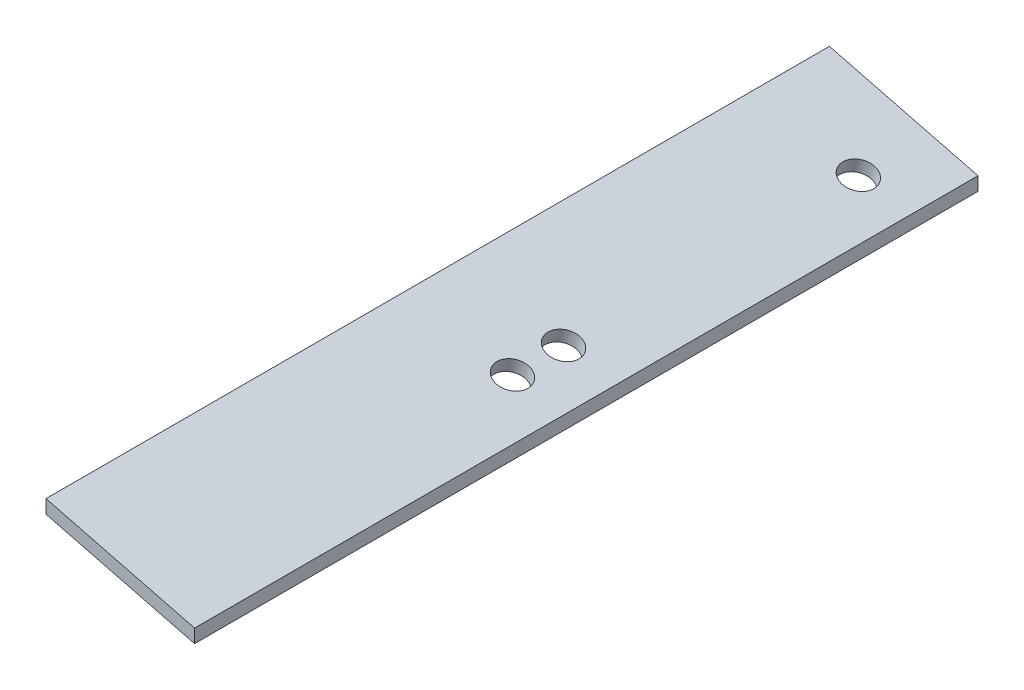
ISO-10303-21;
HEADER;
FILE_DESCRIPTION(('STEP AP214'),'2;1');
FILE_NAME('part.step','',(''),(''),'','','');
FILE_SCHEMA(('AUTOMOTIVE_DESIGN { 1 0 10303 214 1 1 1 1 }'));
ENDSEC;
DATA;
#1=APPLICATION_CONTEXT('core data for automotive mechanical design processes');
#2=APPLICATION_PROTOCOL_DEFINITION('international standard','automotive_design',2000,#1);
#3=PRODUCT_CONTEXT('',#1,'mechanical');
#4=PRODUCT('Part','Part','',(#3));
#5=PRODUCT_RELATED_PRODUCT_CATEGORY('part','',(#4));
#6=PRODUCT_DEFINITION_FORMATION('','',#4);
#7=PRODUCT_DEFINITION_CONTEXT('part definition',#1,'design');
#8=PRODUCT_DEFINITION('design','',#6,#7);
#9=PRODUCT_DEFINITION_SHAPE('','',#8);
#10=(LENGTH_UNIT() NAMED_UNIT(*) SI_UNIT(.MILLI.,.METRE.));
#11=(NAMED_UNIT(*) PLANE_ANGLE_UNIT() SI_UNIT($,.RADIAN.));
#12=(NAMED_UNIT(*) SI_UNIT($,.STERADIAN.) SOLID_ANGLE_UNIT());
#13=UNCERTAINTY_MEASURE_WITH_UNIT(LENGTH_MEASURE(1.E-05),#10,'distance_accuracy_value','');
#14=(GEOMETRIC_REPRESENTATION_CONTEXT(3) GLOBAL_UNCERTAINTY_ASSIGNED_CONTEXT((#13)) GLOBAL_UNIT_ASSIGNED_CONTEXT((#10,
#11,#12)) REPRESENTATION_CONTEXT('',''));
#15=CARTESIAN_POINT('',(0.,0.,0.));
#16=DIRECTION('',(0.,0.,1.));
#17=DIRECTION('',(1.,0.,0.));
#18=AXIS2_PLACEMENT_3D('',#15,#16,#17);
#19=CARTESIAN_POINT('',(120.,145.,-580.));
#20=DIRECTION('',(1.,0.,0.));
#21=DIRECTION('',(0.,1.,0.));
#22=AXIS2_PLACEMENT_3D('',#19,#20,#21);
#23=PLANE('',#22);
#24=DIRECTION('',(0.,1.,0.));
#25=VECTOR('',#24,1.);
#26=CARTESIAN_POINT('',(120.,145.,0.));
#27=LINE('',#26,#25);
#28=CARTESIAN_POINT('',(120.,145.,0.));
#29=VERTEX_POINT('',#28);
#30=CARTESIAN_POINT('',(120.,155.,0.));
#31=VERTEX_POINT('',#30);
#32=EDGE_CURVE('E97',#29,#31,#27,.T.);
#33=ORIENTED_EDGE('',*,*,#32,.F.);
#34=DIRECTION('',(0.,0.,1.));
#35=VECTOR('',#34,1.);
#36=CARTESIAN_POINT('',(120.,145.,-580.));
#37=LINE('',#36,#35);
#38=CARTESIAN_POINT('',(120.,145.,-580.));
#39=VERTEX_POINT('',#38);
#40=EDGE_CURVE('E11',#39,#29,#37,.T.);
#41=ORIENTED_EDGE('',*,*,#40,.F.);
#42=DIRECTION('',(0.,1.,0.));
#43=VECTOR('',#42,1.);
#44=CARTESIAN_POINT('',(120.,145.,-580.));
#45=LINE('',#44,#43);
#46=CARTESIAN_POINT('',(120.,155.,-580.));
#47=VERTEX_POINT('',#46);
#48=EDGE_CURVE('E90',#39,#47,#45,.T.);
#49=ORIENTED_EDGE('',*,*,#48,.T.);
#50=DIRECTION('',(0.,0.,1.));
#51=VECTOR('',#50,1.);
#52=CARTESIAN_POINT('',(120.,155.,-580.));
#53=LINE('',#52,#51);
#54=EDGE_CURVE('E35',#47,#31,#53,.T.);
#55=ORIENTED_EDGE('',*,*,#54,.T.);
#56=EDGE_LOOP('',(#33,#41,#49,#55));
#57=FACE_BOUND('',#56,.T.);
#58=ADVANCED_FACE('F32',(#57),#23,.T.);
#59=CARTESIAN_POINT('',(10.,173.,-580.));
#60=DIRECTION('',(-0.246679280634931,-0.969097173922942,0.));
#61=DIRECTION('',(0.969097173922942,-0.246679280634931,0.));
#62=AXIS2_PLACEMENT_3D('',#59,#60,#61);
#63=PLANE('',#62);
#64=CARTESIAN_POINT('',(82.0319778829853,154.664587447967,-527.));
#65=DIRECTION('',(-0.246679280634931,-0.969097173922942,0.));
#66=DIRECTION('',(0.969097173922942,-0.246679280634931,0.));
#67=AXIS2_PLACEMENT_3D('',#64,#65,#66);
#68=CIRCLE('',#67,11.8);
#69=CARTESIAN_POINT('',(93.467324535276,151.753771936475,-527.));
#70=VERTEX_POINT('',#69);
#71=EDGE_CURVE('E147',#70,#70,#68,.T.);
#72=ORIENTED_EDGE('',*,*,#71,.F.);
#73=EDGE_LOOP('',(#72));
#74=FACE_BOUND('',#73,.T.);
#75=CARTESIAN_POINT('',(82.0319778829851,154.664587447967,-270.946985720668));
#76=DIRECTION('',(-0.246679280634931,-0.969097173922942,0.));
#77=DIRECTION('',(0.969097173922942,-0.246679280634931,0.));
#78=AXIS2_PLACEMENT_3D('',#75,#76,#77);
#79=CIRCLE('',#78,11.8);
#80=CARTESIAN_POINT('',(93.4673245352758,151.753771936475,-270.946985720668));
#81=VERTEX_POINT('',#80);
#82=EDGE_CURVE('E140',#81,#81,#79,.T.);
#83=ORIENTED_EDGE('',*,*,#82,.F.);
#84=EDGE_LOOP('',(#83));
#85=FACE_BOUND('',#84,.T.);
#86=CARTESIAN_POINT('',(82.0319778829868,154.664587447967,-308.745926627754));
#87=DIRECTION('',(-0.246679280634931,-0.969097173922942,0.));
#88=DIRECTION('',(0.969097173922942,-0.246679280634931,0.));
#89=AXIS2_PLACEMENT_3D('',#86,#87,#88);
#90=CIRCLE('',#89,11.8);
#91=CARTESIAN_POINT('',(93.4673245352774,151.753771936475,-308.745926627754));
#92=VERTEX_POINT('',#91);
#93=EDGE_CURVE('E101',#92,#92,#90,.T.);
#94=ORIENTED_EDGE('',*,*,#93,.F.);
#95=EDGE_LOOP('',(#94));
#96=FACE_BOUND('',#95,.T.);
#97=DIRECTION('',(0.969097173922942,-0.246679280634931,0.));
#98=VECTOR('',#97,1.);
#99=CARTESIAN_POINT('',(10.,173.,0.));
#100=LINE('',#99,#98);
#101=CARTESIAN_POINT('',(10.,173.,0.));
#102=VERTEX_POINT('',#101);
#103=EDGE_CURVE('E92',#102,#29,#100,.T.);
#104=ORIENTED_EDGE('',*,*,#103,.F.);
#105=DIRECTION('',(0.,0.,1.));
#106=VECTOR('',#105,1.);
#107=CARTESIAN_POINT('',(10.,173.,-580.));
#108=LINE('',#107,#106);
#109=CARTESIAN_POINT('',(10.,173.,-580.));
#110=VERTEX_POINT('',#109);
#111=EDGE_CURVE('E41',#110,#102,#108,.T.);
#112=ORIENTED_EDGE('',*,*,#111,.F.);
#113=DIRECTION('',(0.969097173922942,-0.246679280634931,0.));
#114=VECTOR('',#113,1.);
#115=CARTESIAN_POINT('',(10.,173.,-580.));
#116=LINE('',#115,#114);
#117=EDGE_CURVE('E87',#110,#39,#116,.T.);
#118=ORIENTED_EDGE('',*,*,#117,.T.);
#119=ORIENTED_EDGE('',*,*,#40,.T.);
#120=EDGE_LOOP('',(#104,#112,#118,#119));
#121=FACE_BOUND('',#120,.T.);
#122=ADVANCED_FACE('F108',(#74,#85,#96,#121),#63,.T.);
#123=CARTESIAN_POINT('',(10.,183.,-580.));
#124=DIRECTION('',(-1.,0.,0.));
#125=DIRECTION('',(0.,0.,1.));
#126=AXIS2_PLACEMENT_3D('',#123,#124,#125);
#127=PLANE('',#126);
#128=DIRECTION('',(0.,-1.,0.));
#129=VECTOR('',#128,1.);
#130=CARTESIAN_POINT('',(10.,183.,0.));
#131=LINE('',#130,#129);
#132=CARTESIAN_POINT('',(10.,183.,0.));
#133=VERTEX_POINT('',#132);
#134=EDGE_CURVE('E82',#133,#102,#131,.T.);
#135=ORIENTED_EDGE('',*,*,#134,.F.);
#136=DIRECTION('',(0.,0.,1.));
#137=VECTOR('',#136,1.);
#138=CARTESIAN_POINT('',(10.,183.,-580.));
#139=LINE('',#138,#137);
#140=CARTESIAN_POINT('',(10.,183.,-580.));
#141=VERTEX_POINT('',#140);
#142=EDGE_CURVE('E77',#141,#133,#139,.T.);
#143=ORIENTED_EDGE('',*,*,#142,.F.);
#144=DIRECTION('',(0.,-1.,0.));
#145=VECTOR('',#144,1.);
#146=CARTESIAN_POINT('',(10.,183.,-580.));
#147=LINE('',#146,#145);
#148=EDGE_CURVE('E80',#141,#110,#147,.T.);
#149=ORIENTED_EDGE('',*,*,#148,.T.);
#150=ORIENTED_EDGE('',*,*,#111,.T.);
#151=EDGE_LOOP('',(#135,#143,#149,#150));
#152=FACE_BOUND('',#151,.T.);
#153=ADVANCED_FACE('F79',(#152),#127,.T.);
#154=CARTESIAN_POINT('',(120.,155.,-580.));
#155=DIRECTION('',(0.246679280634931,0.969097173922942,0.));
#156=DIRECTION('',(-0.969097173922942,0.246679280634931,0.));
#157=AXIS2_PLACEMENT_3D('',#154,#155,#156);
#158=PLANE('',#157);
#159=CARTESIAN_POINT('',(84.4225398202719,164.056080773022,-527.));
#160=DIRECTION('',(0.246679280634931,0.969097173922942,0.));
#161=DIRECTION('',(-0.969097173922942,0.246679280634931,0.));
#162=AXIS2_PLACEMENT_3D('',#159,#160,#161);
#163=CIRCLE('',#162,11.8);
#164=CARTESIAN_POINT('',(72.9871931679812,166.966896284514,-527.));
#165=VERTEX_POINT('',#164);
#166=EDGE_CURVE('E131',#165,#165,#163,.T.);
#167=ORIENTED_EDGE('',*,*,#166,.F.);
#168=EDGE_LOOP('',(#167));
#169=FACE_BOUND('',#168,.T.);
#170=CARTESIAN_POINT('',(84.4225398202717,164.056080773022,-270.946985720668));
#171=DIRECTION('',(0.246679280634931,0.969097173922942,0.));
#172=DIRECTION('',(-0.969097173922942,0.246679280634931,0.));
#173=AXIS2_PLACEMENT_3D('',#170,#171,#172);
#174=CIRCLE('',#173,11.8);
#175=CARTESIAN_POINT('',(72.987193167981,166.966896284514,-270.946985720668));
#176=VERTEX_POINT('',#175);
#177=EDGE_CURVE('E135',#176,#176,#174,.T.);
#178=ORIENTED_EDGE('',*,*,#177,.F.);
#179=EDGE_LOOP('',(#178));
#180=FACE_BOUND('',#179,.T.);
#181=CARTESIAN_POINT('',(84.4225398202733,164.056080773021,-308.745926627754));
#182=DIRECTION('',(0.246679280634931,0.969097173922942,0.));
#183=DIRECTION('',(-0.969097173922942,0.246679280634931,0.));
#184=AXIS2_PLACEMENT_3D('',#181,#182,#183);
#185=CIRCLE('',#184,11.8);
#186=CARTESIAN_POINT('',(72.9871931679826,166.966896284513,-308.745926627754));
#187=VERTEX_POINT('',#186);
#188=EDGE_CURVE('E138',#187,#187,#185,.T.);
#189=ORIENTED_EDGE('',*,*,#188,.F.);
#190=EDGE_LOOP('',(#189));
#191=FACE_BOUND('',#190,.T.);
#192=DIRECTION('',(-0.969097173922942,0.246679280634931,0.));
#193=VECTOR('',#192,1.);
#194=CARTESIAN_POINT('',(120.,155.,0.));
#195=LINE('',#194,#193);
#196=EDGE_CURVE('E100',#31,#133,#195,.T.);
#197=ORIENTED_EDGE('',*,*,#196,.F.);
#198=ORIENTED_EDGE('',*,*,#54,.F.);
#199=DIRECTION('',(-0.969097173922942,0.246679280634931,0.));
#200=VECTOR('',#199,1.);
#201=CARTESIAN_POINT('',(120.,155.,-580.));
#202=LINE('',#201,#200);
#203=EDGE_CURVE('E86',#47,#141,#202,.T.);
#204=ORIENTED_EDGE('',*,*,#203,.T.);
#205=ORIENTED_EDGE('',*,*,#142,.T.);
#206=EDGE_LOOP('',(#197,#198,#204,#205));
#207=FACE_BOUND('',#206,.T.);
#208=ADVANCED_FACE('F89',(#169,#180,#191,#207),#158,.T.);
#209=CARTESIAN_POINT('',(0.,0.,-580.));
#210=DIRECTION('',(0.,0.,1.));
#211=DIRECTION('',(1.,0.,0.));
#212=AXIS2_PLACEMENT_3D('',#209,#210,#211);
#213=PLANE('',#212);
#214=ORIENTED_EDGE('',*,*,#48,.F.);
#215=ORIENTED_EDGE('',*,*,#117,.F.);
#216=ORIENTED_EDGE('',*,*,#148,.F.);
#217=ORIENTED_EDGE('',*,*,#203,.F.);
#218=EDGE_LOOP('',(#214,#215,#216,#217));
#219=FACE_BOUND('',#218,.T.);
#220=ADVANCED_FACE('F85',(#219),#213,.F.);
#221=CARTESIAN_POINT('',(0.,0.,0.));
#222=DIRECTION('',(0.,0.,1.));
#223=DIRECTION('',(1.,0.,0.));
#224=AXIS2_PLACEMENT_3D('',#221,#222,#223);
#225=PLANE('',#224);
#226=ORIENTED_EDGE('',*,*,#32,.T.);
#227=ORIENTED_EDGE('',*,*,#196,.T.);
#228=ORIENTED_EDGE('',*,*,#134,.T.);
#229=ORIENTED_EDGE('',*,*,#103,.T.);
#230=EDGE_LOOP('',(#226,#227,#228,#229));
#231=FACE_BOUND('',#230,.T.);
#232=ADVANCED_FACE('F107',(#231),#225,.T.);
#233=CARTESIAN_POINT('',(81.955747013924,154.365109033792,-308.745926627754));
#234=DIRECTION('',(0.246679280634931,0.969097173922942,0.));
#235=DIRECTION('',(-0.969097173922942,0.246679280634931,0.));
#236=AXIS2_PLACEMENT_3D('',#233,#234,#235);
#237=CYLINDRICAL_SURFACE('',#236,11.8);
#238=ORIENTED_EDGE('',*,*,#93,.T.);
#239=EDGE_LOOP('',(#238));
#240=FACE_BOUND('',#239,.T.);
#241=ORIENTED_EDGE('',*,*,#188,.T.);
#242=EDGE_LOOP('',(#241));
#243=FACE_BOUND('',#242,.T.);
#244=ADVANCED_FACE('F159',(#240,#243),#237,.F.);
#245=CARTESIAN_POINT('',(81.9557470139224,154.365109033792,-270.946985720668));
#246=DIRECTION('',(0.246679280634931,0.969097173922942,0.));
#247=DIRECTION('',(-0.969097173922942,0.246679280634931,0.));
#248=AXIS2_PLACEMENT_3D('',#245,#246,#247);
#249=CYLINDRICAL_SURFACE('',#248,11.8);
#250=ORIENTED_EDGE('',*,*,#82,.T.);
#251=EDGE_LOOP('',(#250));
#252=FACE_BOUND('',#251,.T.);
#253=ORIENTED_EDGE('',*,*,#177,.T.);
#254=EDGE_LOOP('',(#253));
#255=FACE_BOUND('',#254,.T.);
#256=ADVANCED_FACE('F153',(#252,#255),#249,.F.);
#257=CARTESIAN_POINT('',(81.9557470139225,154.365109033792,-527.));
#258=DIRECTION('',(0.246679280634931,0.969097173922942,0.));
#259=DIRECTION('',(-0.969097173922942,0.246679280634931,0.));
#260=AXIS2_PLACEMENT_3D('',#257,#258,#259);
#261=CYLINDRICAL_SURFACE('',#260,11.8);
#262=ORIENTED_EDGE('',*,*,#71,.T.);
#263=EDGE_LOOP('',(#262));
#264=FACE_BOUND('',#263,.T.);
#265=ORIENTED_EDGE('',*,*,#166,.T.);
#266=EDGE_LOOP('',(#265));
#267=FACE_BOUND('',#266,.T.);
#268=ADVANCED_FACE('F151',(#264,#267),#261,.F.);
#269=CLOSED_SHELL('',(#58,#122,#153,#208,#220,#232,#244,#256,#268));
#270=MANIFOLD_SOLID_BREP('B2',#269);
#271=ADVANCED_BREP_SHAPE_REPRESENTATION('',(#18,#270),#14);
#272=SHAPE_DEFINITION_REPRESENTATION(#9,#271);
ENDSEC;
END-ISO-10303-21;
